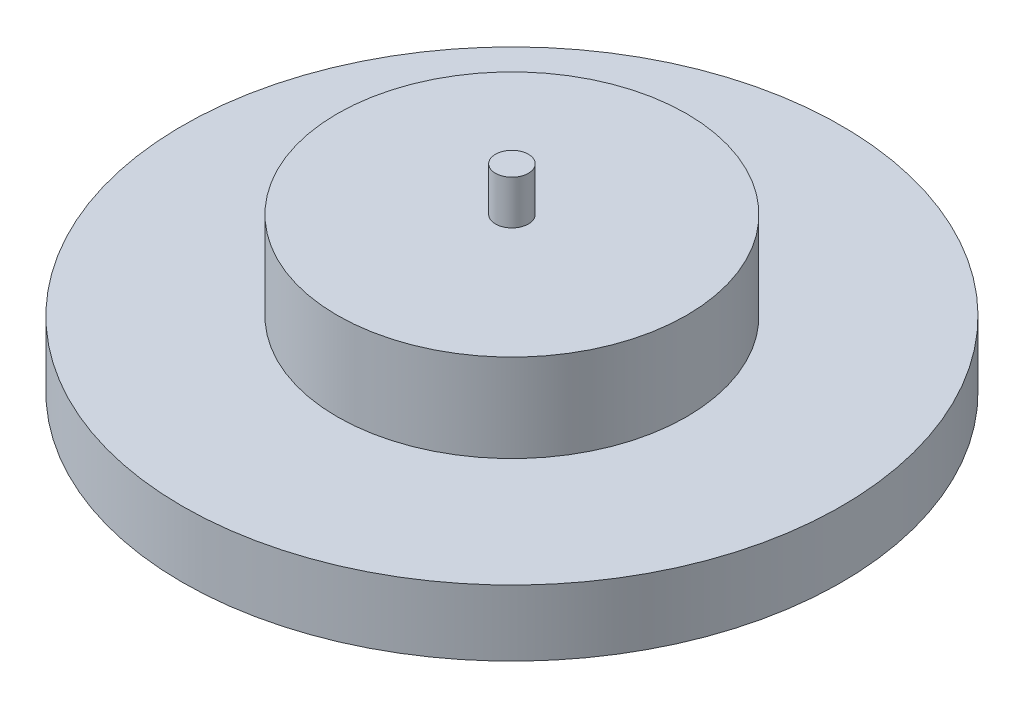
ISO-10303-21;
HEADER;
FILE_DESCRIPTION(('STEP AP214'),'2;1');
FILE_NAME('part.step','',(''),(''),'','','');
FILE_SCHEMA(('AUTOMOTIVE_DESIGN { 1 0 10303 214 1 1 1 1 }'));
ENDSEC;
DATA;
#1=APPLICATION_CONTEXT('core data for automotive mechanical design processes');
#2=APPLICATION_PROTOCOL_DEFINITION('international standard','automotive_design',2000,#1);
#3=PRODUCT_CONTEXT('',#1,'mechanical');
#4=PRODUCT('Part','Part','',(#3));
#5=PRODUCT_RELATED_PRODUCT_CATEGORY('part','',(#4));
#6=PRODUCT_DEFINITION_FORMATION('','',#4);
#7=PRODUCT_DEFINITION_CONTEXT('part definition',#1,'design');
#8=PRODUCT_DEFINITION('design','',#6,#7);
#9=PRODUCT_DEFINITION_SHAPE('','',#8);
#10=(LENGTH_UNIT() NAMED_UNIT(*) SI_UNIT(.MILLI.,.METRE.));
#11=(NAMED_UNIT(*) PLANE_ANGLE_UNIT() SI_UNIT($,.RADIAN.));
#12=(NAMED_UNIT(*) SI_UNIT($,.STERADIAN.) SOLID_ANGLE_UNIT());
#13=UNCERTAINTY_MEASURE_WITH_UNIT(LENGTH_MEASURE(1.E-05),#10,'distance_accuracy_value','');
#14=(GEOMETRIC_REPRESENTATION_CONTEXT(3) GLOBAL_UNCERTAINTY_ASSIGNED_CONTEXT((#13)) GLOBAL_UNIT_ASSIGNED_CONTEXT((#10,
#11,#12)) REPRESENTATION_CONTEXT('',''));
#15=CARTESIAN_POINT('',(0.,0.,0.));
#16=DIRECTION('',(0.,0.,1.));
#17=DIRECTION('',(1.,0.,0.));
#18=AXIS2_PLACEMENT_3D('',#15,#16,#17);
#19=CARTESIAN_POINT('',(0.,3.,0.));
#20=DIRECTION('',(0.,-1.,0.));
#21=DIRECTION('',(0.,0.,-1.));
#22=AXIS2_PLACEMENT_3D('',#19,#20,#21);
#23=CYLINDRICAL_SURFACE('',#22,15.);
#24=CARTESIAN_POINT('',(0.,3.,0.));
#25=DIRECTION('',(0.,1.,0.));
#26=DIRECTION('',(0.,0.,1.));
#27=AXIS2_PLACEMENT_3D('',#24,#25,#26);
#28=CIRCLE('',#27,15.);
#29=CARTESIAN_POINT('',(0.,3.,15.));
#30=VERTEX_POINT('',#29);
#31=EDGE_CURVE('E46',#30,#30,#28,.T.);
#32=ORIENTED_EDGE('',*,*,#31,.F.);
#33=EDGE_LOOP('',(#32));
#34=FACE_BOUND('',#33,.T.);
#35=CARTESIAN_POINT('',(0.,0.,0.));
#36=DIRECTION('',(0.,1.,0.));
#37=DIRECTION('',(0.,0.,1.));
#38=AXIS2_PLACEMENT_3D('',#35,#36,#37);
#39=CIRCLE('',#38,15.);
#40=CARTESIAN_POINT('',(0.,0.,15.));
#41=VERTEX_POINT('',#40);
#42=EDGE_CURVE('E42',#41,#41,#39,.T.);
#43=ORIENTED_EDGE('',*,*,#42,.T.);
#44=EDGE_LOOP('',(#43));
#45=FACE_BOUND('',#44,.T.);
#46=ADVANCED_FACE('F39',(#34,#45),#23,.T.);
#47=CARTESIAN_POINT('',(0.,3.,0.));
#48=DIRECTION('',(0.,1.,0.));
#49=DIRECTION('',(0.,0.,1.));
#50=AXIS2_PLACEMENT_3D('',#47,#48,#49);
#51=PLANE('',#50);
#52=CARTESIAN_POINT('',(0.,3.,0.));
#53=DIRECTION('',(0.,1.,0.));
#54=DIRECTION('',(0.,0.,1.));
#55=AXIS2_PLACEMENT_3D('',#52,#53,#54);
#56=CIRCLE('',#55,7.95);
#57=CARTESIAN_POINT('',(0.,3.,7.95));
#58=VERTEX_POINT('',#57);
#59=EDGE_CURVE('E10',#58,#58,#56,.T.);
#60=ORIENTED_EDGE('',*,*,#59,.F.);
#61=EDGE_LOOP('',(#60));
#62=FACE_BOUND('',#61,.T.);
#63=ORIENTED_EDGE('',*,*,#31,.T.);
#64=EDGE_LOOP('',(#63));
#65=FACE_BOUND('',#64,.T.);
#66=ADVANCED_FACE('F84',(#62,#65),#51,.T.);
#67=CARTESIAN_POINT('',(0.,0.,0.));
#68=DIRECTION('',(0.,1.,0.));
#69=DIRECTION('',(0.,0.,1.));
#70=AXIS2_PLACEMENT_3D('',#67,#68,#69);
#71=PLANE('',#70);
#72=ORIENTED_EDGE('',*,*,#42,.F.);
#73=EDGE_LOOP('',(#72));
#74=FACE_BOUND('',#73,.T.);
#75=ADVANCED_FACE('F78',(#74),#71,.F.);
#76=CARTESIAN_POINT('',(0.,7.,0.));
#77=DIRECTION('',(0.,-1.,0.));
#78=DIRECTION('',(0.,0.,-1.));
#79=AXIS2_PLACEMENT_3D('',#76,#77,#78);
#80=CYLINDRICAL_SURFACE('',#79,7.95);
#81=CARTESIAN_POINT('',(0.,7.,0.));
#82=DIRECTION('',(0.,1.,0.));
#83=DIRECTION('',(0.,0.,1.));
#84=AXIS2_PLACEMENT_3D('',#81,#82,#83);
#85=CIRCLE('',#84,7.95);
#86=CARTESIAN_POINT('',(0.,7.,7.95));
#87=VERTEX_POINT('',#86);
#88=EDGE_CURVE('E52',#87,#87,#85,.T.);
#89=ORIENTED_EDGE('',*,*,#88,.F.);
#90=EDGE_LOOP('',(#89));
#91=FACE_BOUND('',#90,.T.);
#92=ORIENTED_EDGE('',*,*,#59,.T.);
#93=EDGE_LOOP('',(#92));
#94=FACE_BOUND('',#93,.T.);
#95=ADVANCED_FACE('F73',(#91,#94),#80,.T.);
#96=CARTESIAN_POINT('',(0.,7.,0.));
#97=DIRECTION('',(0.,1.,0.));
#98=DIRECTION('',(0.,0.,1.));
#99=AXIS2_PLACEMENT_3D('',#96,#97,#98);
#100=PLANE('',#99);
#101=CARTESIAN_POINT('',(0.,7.,0.));
#102=DIRECTION('',(0.,1.,0.));
#103=DIRECTION('',(0.,0.,1.));
#104=AXIS2_PLACEMENT_3D('',#101,#102,#103);
#105=CIRCLE('',#104,0.75);
#106=CARTESIAN_POINT('',(0.,7.,0.75));
#107=VERTEX_POINT('',#106);
#108=EDGE_CURVE('E56',#107,#107,#105,.T.);
#109=ORIENTED_EDGE('',*,*,#108,.F.);
#110=EDGE_LOOP('',(#109));
#111=FACE_BOUND('',#110,.T.);
#112=ORIENTED_EDGE('',*,*,#88,.T.);
#113=EDGE_LOOP('',(#112));
#114=FACE_BOUND('',#113,.T.);
#115=ADVANCED_FACE('F67',(#111,#114),#100,.T.);
#116=CARTESIAN_POINT('',(0.,9.,0.));
#117=DIRECTION('',(0.,-1.,0.));
#118=DIRECTION('',(0.,0.,-1.));
#119=AXIS2_PLACEMENT_3D('',#116,#117,#118);
#120=CYLINDRICAL_SURFACE('',#119,0.75);
#121=CARTESIAN_POINT('',(0.,9.,0.));
#122=DIRECTION('',(0.,1.,0.));
#123=DIRECTION('',(0.,0.,1.));
#124=AXIS2_PLACEMENT_3D('',#121,#122,#123);
#125=CIRCLE('',#124,0.75);
#126=CARTESIAN_POINT('',(0.,9.,0.75));
#127=VERTEX_POINT('',#126);
#128=EDGE_CURVE('E55',#127,#127,#125,.T.);
#129=ORIENTED_EDGE('',*,*,#128,.F.);
#130=EDGE_LOOP('',(#129));
#131=FACE_BOUND('',#130,.T.);
#132=ORIENTED_EDGE('',*,*,#108,.T.);
#133=EDGE_LOOP('',(#132));
#134=FACE_BOUND('',#133,.T.);
#135=ADVANCED_FACE('F64',(#131,#134),#120,.T.);
#136=CARTESIAN_POINT('',(0.,9.,0.));
#137=DIRECTION('',(0.,1.,0.));
#138=DIRECTION('',(0.,0.,1.));
#139=AXIS2_PLACEMENT_3D('',#136,#137,#138);
#140=PLANE('',#139);
#141=ORIENTED_EDGE('',*,*,#128,.T.);
#142=EDGE_LOOP('',(#141));
#143=FACE_BOUND('',#142,.T.);
#144=ADVANCED_FACE('F62',(#143),#140,.T.);
#145=CLOSED_SHELL('',(#46,#66,#75,#95,#115,#135,#144));
#146=MANIFOLD_SOLID_BREP('B2',#145);
#147=ADVANCED_BREP_SHAPE_REPRESENTATION('',(#18,#146),#14);
#148=SHAPE_DEFINITION_REPRESENTATION(#9,#147);
ENDSEC;
END-ISO-10303-21;
